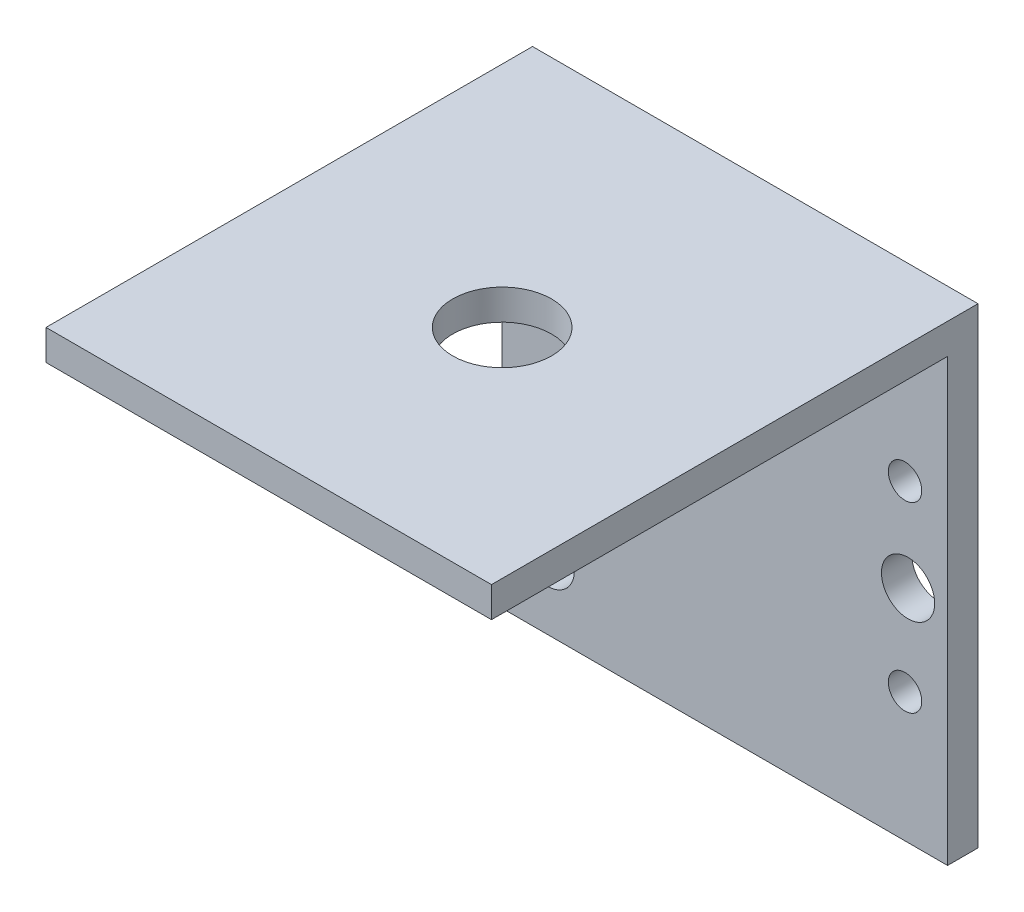
ISO-10303-21;
HEADER;
FILE_DESCRIPTION(('STEP AP214'),'2;1');
FILE_NAME('part.step','',(''),(''),'','','');
FILE_SCHEMA(('AUTOMOTIVE_DESIGN { 1 0 10303 214 1 1 1 1 }'));
ENDSEC;
DATA;
#1=APPLICATION_CONTEXT('core data for automotive mechanical design processes');
#2=APPLICATION_PROTOCOL_DEFINITION('international standard','automotive_design',2000,#1);
#3=PRODUCT_CONTEXT('',#1,'mechanical');
#4=PRODUCT('Part','Part','',(#3));
#5=PRODUCT_RELATED_PRODUCT_CATEGORY('part','',(#4));
#6=PRODUCT_DEFINITION_FORMATION('','',#4);
#7=PRODUCT_DEFINITION_CONTEXT('part definition',#1,'design');
#8=PRODUCT_DEFINITION('design','',#6,#7);
#9=PRODUCT_DEFINITION_SHAPE('','',#8);
#10=(LENGTH_UNIT() NAMED_UNIT(*) SI_UNIT(.MILLI.,.METRE.));
#11=(NAMED_UNIT(*) PLANE_ANGLE_UNIT() SI_UNIT($,.RADIAN.));
#12=(NAMED_UNIT(*) SI_UNIT($,.STERADIAN.) SOLID_ANGLE_UNIT());
#13=UNCERTAINTY_MEASURE_WITH_UNIT(LENGTH_MEASURE(1.E-05),#10,'distance_accuracy_value','');
#14=(GEOMETRIC_REPRESENTATION_CONTEXT(3) GLOBAL_UNCERTAINTY_ASSIGNED_CONTEXT((#13)) GLOBAL_UNIT_ASSIGNED_CONTEXT((#10,
#11,#12)) REPRESENTATION_CONTEXT('',''));
#15=CARTESIAN_POINT('',(0.,0.,0.));
#16=DIRECTION('',(0.,0.,1.));
#17=DIRECTION('',(1.,0.,0.));
#18=AXIS2_PLACEMENT_3D('',#15,#16,#17);
#19=CARTESIAN_POINT('',(14.65,14.5,2.));
#20=DIRECTION('',(-1.,0.,0.));
#21=DIRECTION('',(0.,-1.,0.));
#22=AXIS2_PLACEMENT_3D('',#19,#20,#21);
#23=PLANE('',#22);
#24=DIRECTION('',(0.,1.,0.));
#25=VECTOR('',#24,1.);
#26=CARTESIAN_POINT('',(14.65,14.5,0.));
#27=LINE('',#26,#25);
#28=CARTESIAN_POINT('',(14.65,-14.5,0.));
#29=VERTEX_POINT('',#28);
#30=CARTESIAN_POINT('',(14.65,16.5,0.));
#31=VERTEX_POINT('',#30);
#32=EDGE_CURVE('E101',#29,#31,#27,.T.);
#33=ORIENTED_EDGE('',*,*,#32,.T.);
#34=DIRECTION('',(0.,0.,1.));
#35=VECTOR('',#34,1.);
#36=CARTESIAN_POINT('',(14.65,16.5,0.));
#37=LINE('',#36,#35);
#38=CARTESIAN_POINT('',(14.65,16.5,32.));
#39=VERTEX_POINT('',#38);
#40=EDGE_CURVE('E132',#31,#39,#37,.T.);
#41=ORIENTED_EDGE('',*,*,#40,.T.);
#42=DIRECTION('',(0.,1.,0.));
#43=VECTOR('',#42,1.);
#44=CARTESIAN_POINT('',(14.65,14.5,32.));
#45=LINE('',#44,#43);
#46=CARTESIAN_POINT('',(14.65,14.5,32.));
#47=VERTEX_POINT('',#46);
#48=EDGE_CURVE('E125',#47,#39,#45,.T.);
#49=ORIENTED_EDGE('',*,*,#48,.F.);
#50=DIRECTION('',(0.,0.,1.));
#51=VECTOR('',#50,1.);
#52=CARTESIAN_POINT('',(14.65,14.5,0.));
#53=LINE('',#52,#51);
#54=CARTESIAN_POINT('',(14.65,14.5,2.));
#55=VERTEX_POINT('',#54);
#56=EDGE_CURVE('E88',#55,#47,#53,.T.);
#57=ORIENTED_EDGE('',*,*,#56,.F.);
#58=DIRECTION('',(0.,1.,0.));
#59=VECTOR('',#58,1.);
#60=CARTESIAN_POINT('',(14.65,14.5,2.));
#61=LINE('',#60,#59);
#62=CARTESIAN_POINT('',(14.65,-14.5,2.));
#63=VERTEX_POINT('',#62);
#64=EDGE_CURVE('E94',#63,#55,#61,.T.);
#65=ORIENTED_EDGE('',*,*,#64,.F.);
#66=DIRECTION('',(0.,0.,-1.));
#67=VECTOR('',#66,1.);
#68=CARTESIAN_POINT('',(14.65,-14.5,2.));
#69=LINE('',#68,#67);
#70=EDGE_CURVE('E44',#63,#29,#69,.T.);
#71=ORIENTED_EDGE('',*,*,#70,.T.);
#72=EDGE_LOOP('',(#33,#41,#49,#57,#65,#71));
#73=FACE_BOUND('',#72,.T.);
#74=ADVANCED_FACE('F35',(#73),#23,.F.);
#75=CARTESIAN_POINT('',(-14.65,14.5,2.));
#76=DIRECTION('',(1.,0.,0.));
#77=DIRECTION('',(0.,1.,0.));
#78=AXIS2_PLACEMENT_3D('',#75,#76,#77);
#79=PLANE('',#78);
#80=DIRECTION('',(0.,-1.,0.));
#81=VECTOR('',#80,1.);
#82=CARTESIAN_POINT('',(-14.65,14.5,0.));
#83=LINE('',#82,#81);
#84=CARTESIAN_POINT('',(-14.65,16.5,0.));
#85=VERTEX_POINT('',#84);
#86=CARTESIAN_POINT('',(-14.65,-14.5,0.));
#87=VERTEX_POINT('',#86);
#88=EDGE_CURVE('E64',#85,#87,#83,.T.);
#89=ORIENTED_EDGE('',*,*,#88,.T.);
#90=DIRECTION('',(0.,0.,-1.));
#91=VECTOR('',#90,1.);
#92=CARTESIAN_POINT('',(-14.65,-14.5,2.));
#93=LINE('',#92,#91);
#94=CARTESIAN_POINT('',(-14.65,-14.5,2.));
#95=VERTEX_POINT('',#94);
#96=EDGE_CURVE('E11',#95,#87,#93,.T.);
#97=ORIENTED_EDGE('',*,*,#96,.F.);
#98=DIRECTION('',(0.,-1.,0.));
#99=VECTOR('',#98,1.);
#100=CARTESIAN_POINT('',(-14.65,14.5,2.));
#101=LINE('',#100,#99);
#102=CARTESIAN_POINT('',(-14.65,14.5,2.));
#103=VERTEX_POINT('',#102);
#104=EDGE_CURVE('E92',#103,#95,#101,.T.);
#105=ORIENTED_EDGE('',*,*,#104,.F.);
#106=DIRECTION('',(0.,0.,1.));
#107=VECTOR('',#106,1.);
#108=CARTESIAN_POINT('',(-14.65,14.5,0.));
#109=LINE('',#108,#107);
#110=CARTESIAN_POINT('',(-14.65,14.5,32.));
#111=VERTEX_POINT('',#110);
#112=EDGE_CURVE('E80',#103,#111,#109,.T.);
#113=ORIENTED_EDGE('',*,*,#112,.T.);
#114=DIRECTION('',(0.,-1.,0.));
#115=VECTOR('',#114,1.);
#116=CARTESIAN_POINT('',(-14.65,14.5,32.));
#117=LINE('',#116,#115);
#118=CARTESIAN_POINT('',(-14.65,16.5,32.));
#119=VERTEX_POINT('',#118);
#120=EDGE_CURVE('E345',#119,#111,#117,.T.);
#121=ORIENTED_EDGE('',*,*,#120,.F.);
#122=DIRECTION('',(0.,0.,1.));
#123=VECTOR('',#122,1.);
#124=CARTESIAN_POINT('',(-14.65,16.5,0.));
#125=LINE('',#124,#123);
#126=EDGE_CURVE('E129',#85,#119,#125,.T.);
#127=ORIENTED_EDGE('',*,*,#126,.F.);
#128=EDGE_LOOP('',(#89,#97,#105,#113,#121,#127));
#129=FACE_BOUND('',#128,.T.);
#130=ADVANCED_FACE('F96',(#129),#79,.F.);
#131=CARTESIAN_POINT('',(-14.65,-14.5,2.));
#132=DIRECTION('',(0.,1.,0.));
#133=DIRECTION('',(0.,0.,1.));
#134=AXIS2_PLACEMENT_3D('',#131,#132,#133);
#135=PLANE('',#134);
#136=DIRECTION('',(1.,0.,0.));
#137=VECTOR('',#136,1.);
#138=CARTESIAN_POINT('',(-14.65,-14.5,0.));
#139=LINE('',#138,#137);
#140=EDGE_CURVE('E106',#87,#29,#139,.T.);
#141=ORIENTED_EDGE('',*,*,#140,.T.);
#142=ORIENTED_EDGE('',*,*,#70,.F.);
#143=DIRECTION('',(1.,0.,0.));
#144=VECTOR('',#143,1.);
#145=CARTESIAN_POINT('',(-14.65,-14.5,2.));
#146=LINE('',#145,#144);
#147=EDGE_CURVE('E52',#95,#63,#146,.T.);
#148=ORIENTED_EDGE('',*,*,#147,.F.);
#149=ORIENTED_EDGE('',*,*,#96,.T.);
#150=EDGE_LOOP('',(#141,#142,#148,#149));
#151=FACE_BOUND('',#150,.T.);
#152=ADVANCED_FACE('F179',(#151),#135,.F.);
#153=CARTESIAN_POINT('',(0.,0.,2.));
#154=DIRECTION('',(0.,0.,1.));
#155=DIRECTION('',(1.,0.,0.));
#156=AXIS2_PLACEMENT_3D('',#153,#154,#155);
#157=PLANE('',#156);
#158=CARTESIAN_POINT('',(-10.15,-6.0048125160935,2.));
#159=DIRECTION('',(0.,0.,1.));
#160=DIRECTION('',(1.,0.,0.));
#161=AXIS2_PLACEMENT_3D('',#158,#159,#160);
#162=CIRCLE('',#161,1.1);
#163=CARTESIAN_POINT('',(-9.05000000000001,-6.0048125160935,2.));
#164=VERTEX_POINT('',#163);
#165=EDGE_CURVE('E139',#164,#164,#162,.T.);
#166=ORIENTED_EDGE('',*,*,#165,.F.);
#167=EDGE_LOOP('',(#166));
#168=FACE_BOUND('',#167,.T.);
#169=CARTESIAN_POINT('',(11.85,5.9951874839065,2.));
#170=DIRECTION('',(0.,0.,1.));
#171=DIRECTION('',(1.,0.,0.));
#172=AXIS2_PLACEMENT_3D('',#169,#170,#171);
#173=CIRCLE('',#172,1.1);
#174=CARTESIAN_POINT('',(12.95,5.9951874839065,2.));
#175=VERTEX_POINT('',#174);
#176=EDGE_CURVE('E145',#175,#175,#173,.T.);
#177=ORIENTED_EDGE('',*,*,#176,.F.);
#178=EDGE_LOOP('',(#177));
#179=FACE_BOUND('',#178,.T.);
#180=CARTESIAN_POINT('',(11.85,-6.0048125160935,2.));
#181=DIRECTION('',(0.,0.,1.));
#182=DIRECTION('',(1.,0.,0.));
#183=AXIS2_PLACEMENT_3D('',#180,#181,#182);
#184=CIRCLE('',#183,1.1);
#185=CARTESIAN_POINT('',(12.95,-6.0048125160935,2.));
#186=VERTEX_POINT('',#185);
#187=EDGE_CURVE('E131',#186,#186,#184,.T.);
#188=ORIENTED_EDGE('',*,*,#187,.F.);
#189=EDGE_LOOP('',(#188));
#190=FACE_BOUND('',#189,.T.);
#191=CARTESIAN_POINT('',(-10.15,5.9951874839065,2.));
#192=DIRECTION('',(0.,0.,1.));
#193=DIRECTION('',(1.,0.,0.));
#194=AXIS2_PLACEMENT_3D('',#191,#192,#193);
#195=CIRCLE('',#194,1.1);
#196=CARTESIAN_POINT('',(-9.05000000000001,5.9951874839065,2.));
#197=VERTEX_POINT('',#196);
#198=EDGE_CURVE('E138',#197,#197,#195,.T.);
#199=ORIENTED_EDGE('',*,*,#198,.F.);
#200=EDGE_LOOP('',(#199));
#201=FACE_BOUND('',#200,.T.);
#202=CARTESIAN_POINT('',(-11.65,-10.,2.));
#203=DIRECTION('',(0.,0.,1.));
#204=DIRECTION('',(1.,0.,0.));
#205=AXIS2_PLACEMENT_3D('',#202,#203,#204);
#206=CIRCLE('',#205,1.75);
#207=CARTESIAN_POINT('',(-9.90000000000001,-10.,2.));
#208=VERTEX_POINT('',#207);
#209=EDGE_CURVE('E163',#208,#208,#206,.T.);
#210=ORIENTED_EDGE('',*,*,#209,.F.);
#211=EDGE_LOOP('',(#210));
#212=FACE_BOUND('',#211,.T.);
#213=CARTESIAN_POINT('',(12.05,0.,2.));
#214=DIRECTION('',(0.,0.,1.));
#215=DIRECTION('',(1.,0.,0.));
#216=AXIS2_PLACEMENT_3D('',#213,#214,#215);
#217=CIRCLE('',#216,1.75);
#218=CARTESIAN_POINT('',(13.8,0.,2.));
#219=VERTEX_POINT('',#218);
#220=EDGE_CURVE('E156',#219,#219,#217,.T.);
#221=ORIENTED_EDGE('',*,*,#220,.F.);
#222=EDGE_LOOP('',(#221));
#223=FACE_BOUND('',#222,.T.);
#224=CARTESIAN_POINT('',(-11.65,10.,2.));
#225=DIRECTION('',(0.,0.,1.));
#226=DIRECTION('',(1.,0.,0.));
#227=AXIS2_PLACEMENT_3D('',#224,#225,#226);
#228=CIRCLE('',#227,1.75);
#229=CARTESIAN_POINT('',(-9.90000000000001,10.,2.));
#230=VERTEX_POINT('',#229);
#231=EDGE_CURVE('E162',#230,#230,#228,.T.);
#232=ORIENTED_EDGE('',*,*,#231,.F.);
#233=EDGE_LOOP('',(#232));
#234=FACE_BOUND('',#233,.T.);
#235=ORIENTED_EDGE('',*,*,#64,.T.);
#236=DIRECTION('',(-1.,0.,0.));
#237=VECTOR('',#236,1.);
#238=CARTESIAN_POINT('',(-14.65,14.5,2.));
#239=LINE('',#238,#237);
#240=EDGE_CURVE('E73',#55,#103,#239,.T.);
#241=ORIENTED_EDGE('',*,*,#240,.T.);
#242=ORIENTED_EDGE('',*,*,#104,.T.);
#243=ORIENTED_EDGE('',*,*,#147,.T.);
#244=EDGE_LOOP('',(#235,#241,#242,#243));
#245=FACE_BOUND('',#244,.T.);
#246=ADVANCED_FACE('F91',(#168,#179,#190,#201,#212,#223,#234,#245),#157,.T.);
#247=CARTESIAN_POINT('',(0.,0.,0.));
#248=DIRECTION('',(0.,0.,1.));
#249=DIRECTION('',(1.,0.,0.));
#250=AXIS2_PLACEMENT_3D('',#247,#248,#249);
#251=PLANE('',#250);
#252=CARTESIAN_POINT('',(-10.15,-6.0048125160935,0.));
#253=DIRECTION('',(0.,0.,1.));
#254=DIRECTION('',(1.,0.,0.));
#255=AXIS2_PLACEMENT_3D('',#252,#253,#254);
#256=CIRCLE('',#255,1.1);
#257=CARTESIAN_POINT('',(-9.05000000000001,-6.0048125160935,0.));
#258=VERTEX_POINT('',#257);
#259=EDGE_CURVE('E135',#258,#258,#256,.T.);
#260=ORIENTED_EDGE('',*,*,#259,.T.);
#261=EDGE_LOOP('',(#260));
#262=FACE_BOUND('',#261,.T.);
#263=CARTESIAN_POINT('',(11.85,5.9951874839065,0.));
#264=DIRECTION('',(0.,0.,1.));
#265=DIRECTION('',(1.,0.,0.));
#266=AXIS2_PLACEMENT_3D('',#263,#264,#265);
#267=CIRCLE('',#266,1.1);
#268=CARTESIAN_POINT('',(12.95,5.9951874839065,0.));
#269=VERTEX_POINT('',#268);
#270=EDGE_CURVE('E142',#269,#269,#267,.T.);
#271=ORIENTED_EDGE('',*,*,#270,.T.);
#272=EDGE_LOOP('',(#271));
#273=FACE_BOUND('',#272,.T.);
#274=CARTESIAN_POINT('',(11.85,-6.0048125160935,0.));
#275=DIRECTION('',(0.,0.,1.));
#276=DIRECTION('',(1.,0.,0.));
#277=AXIS2_PLACEMENT_3D('',#274,#275,#276);
#278=CIRCLE('',#277,1.1);
#279=CARTESIAN_POINT('',(12.95,-6.0048125160935,0.));
#280=VERTEX_POINT('',#279);
#281=EDGE_CURVE('E148',#280,#280,#278,.T.);
#282=ORIENTED_EDGE('',*,*,#281,.T.);
#283=EDGE_LOOP('',(#282));
#284=FACE_BOUND('',#283,.T.);
#285=CARTESIAN_POINT('',(-10.15,5.9951874839065,0.));
#286=DIRECTION('',(0.,0.,1.));
#287=DIRECTION('',(1.,0.,0.));
#288=AXIS2_PLACEMENT_3D('',#285,#286,#287);
#289=CIRCLE('',#288,1.1);
#290=CARTESIAN_POINT('',(-9.05000000000001,5.9951874839065,0.));
#291=VERTEX_POINT('',#290);
#292=EDGE_CURVE('E153',#291,#291,#289,.T.);
#293=ORIENTED_EDGE('',*,*,#292,.T.);
#294=EDGE_LOOP('',(#293));
#295=FACE_BOUND('',#294,.T.);
#296=CARTESIAN_POINT('',(-11.65,-10.,0.));
#297=DIRECTION('',(0.,0.,1.));
#298=DIRECTION('',(1.,0.,0.));
#299=AXIS2_PLACEMENT_3D('',#296,#297,#298);
#300=CIRCLE('',#299,1.75);
#301=CARTESIAN_POINT('',(-9.90000000000001,-10.,0.));
#302=VERTEX_POINT('',#301);
#303=EDGE_CURVE('E159',#302,#302,#300,.T.);
#304=ORIENTED_EDGE('',*,*,#303,.T.);
#305=EDGE_LOOP('',(#304));
#306=FACE_BOUND('',#305,.T.);
#307=CARTESIAN_POINT('',(12.05,0.,0.));
#308=DIRECTION('',(0.,0.,1.));
#309=DIRECTION('',(1.,0.,0.));
#310=AXIS2_PLACEMENT_3D('',#307,#308,#309);
#311=CIRCLE('',#310,1.75);
#312=CARTESIAN_POINT('',(13.8,0.,0.));
#313=VERTEX_POINT('',#312);
#314=EDGE_CURVE('E166',#313,#313,#311,.T.);
#315=ORIENTED_EDGE('',*,*,#314,.T.);
#316=EDGE_LOOP('',(#315));
#317=FACE_BOUND('',#316,.T.);
#318=CARTESIAN_POINT('',(-11.65,10.,0.));
#319=DIRECTION('',(0.,0.,1.));
#320=DIRECTION('',(1.,0.,0.));
#321=AXIS2_PLACEMENT_3D('',#318,#319,#320);
#322=CIRCLE('',#321,1.75);
#323=CARTESIAN_POINT('',(-9.90000000000001,10.,0.));
#324=VERTEX_POINT('',#323);
#325=EDGE_CURVE('E104',#324,#324,#322,.T.);
#326=ORIENTED_EDGE('',*,*,#325,.T.);
#327=EDGE_LOOP('',(#326));
#328=FACE_BOUND('',#327,.T.);
#329=ORIENTED_EDGE('',*,*,#32,.F.);
#330=ORIENTED_EDGE('',*,*,#140,.F.);
#331=ORIENTED_EDGE('',*,*,#88,.F.);
#332=DIRECTION('',(-1.,0.,0.));
#333=VECTOR('',#332,1.);
#334=CARTESIAN_POINT('',(-14.65,16.5,0.));
#335=LINE('',#334,#333);
#336=EDGE_CURVE('E89',#31,#85,#335,.T.);
#337=ORIENTED_EDGE('',*,*,#336,.F.);
#338=EDGE_LOOP('',(#329,#330,#331,#337));
#339=FACE_BOUND('',#338,.T.);
#340=ADVANCED_FACE('F117',(#262,#273,#284,#295,#306,#317,#328,#339),#251,.F.);
#341=CARTESIAN_POINT('',(-11.65,10.,0.));
#342=DIRECTION('',(0.,0.,1.));
#343=DIRECTION('',(1.,0.,0.));
#344=AXIS2_PLACEMENT_3D('',#341,#342,#343);
#345=CYLINDRICAL_SURFACE('',#344,1.75);
#346=ORIENTED_EDGE('',*,*,#325,.F.);
#347=EDGE_LOOP('',(#346));
#348=FACE_BOUND('',#347,.T.);
#349=ORIENTED_EDGE('',*,*,#231,.T.);
#350=EDGE_LOOP('',(#349));
#351=FACE_BOUND('',#350,.T.);
#352=ADVANCED_FACE('F176',(#348,#351),#345,.F.);
#353=CARTESIAN_POINT('',(12.05,0.,0.));
#354=DIRECTION('',(0.,0.,1.));
#355=DIRECTION('',(1.,0.,0.));
#356=AXIS2_PLACEMENT_3D('',#353,#354,#355);
#357=CYLINDRICAL_SURFACE('',#356,1.75);
#358=ORIENTED_EDGE('',*,*,#314,.F.);
#359=EDGE_LOOP('',(#358));
#360=FACE_BOUND('',#359,.T.);
#361=ORIENTED_EDGE('',*,*,#220,.T.);
#362=EDGE_LOOP('',(#361));
#363=FACE_BOUND('',#362,.T.);
#364=ADVANCED_FACE('F209',(#360,#363),#357,.F.);
#365=CARTESIAN_POINT('',(-11.65,-10.,0.));
#366=DIRECTION('',(0.,0.,1.));
#367=DIRECTION('',(1.,0.,0.));
#368=AXIS2_PLACEMENT_3D('',#365,#366,#367);
#369=CYLINDRICAL_SURFACE('',#368,1.75);
#370=ORIENTED_EDGE('',*,*,#303,.F.);
#371=EDGE_LOOP('',(#370));
#372=FACE_BOUND('',#371,.T.);
#373=ORIENTED_EDGE('',*,*,#209,.T.);
#374=EDGE_LOOP('',(#373));
#375=FACE_BOUND('',#374,.T.);
#376=ADVANCED_FACE('F217',(#372,#375),#369,.F.);
#377=CARTESIAN_POINT('',(-10.15,5.9951874839065,0.));
#378=DIRECTION('',(0.,0.,1.));
#379=DIRECTION('',(1.,0.,0.));
#380=AXIS2_PLACEMENT_3D('',#377,#378,#379);
#381=CYLINDRICAL_SURFACE('',#380,1.1);
#382=ORIENTED_EDGE('',*,*,#292,.F.);
#383=EDGE_LOOP('',(#382));
#384=FACE_BOUND('',#383,.T.);
#385=ORIENTED_EDGE('',*,*,#198,.T.);
#386=EDGE_LOOP('',(#385));
#387=FACE_BOUND('',#386,.T.);
#388=ADVANCED_FACE('F225',(#384,#387),#381,.F.);
#389=CARTESIAN_POINT('',(11.85,-6.0048125160935,0.));
#390=DIRECTION('',(0.,0.,1.));
#391=DIRECTION('',(1.,0.,0.));
#392=AXIS2_PLACEMENT_3D('',#389,#390,#391);
#393=CYLINDRICAL_SURFACE('',#392,1.1);
#394=ORIENTED_EDGE('',*,*,#281,.F.);
#395=EDGE_LOOP('',(#394));
#396=FACE_BOUND('',#395,.T.);
#397=ORIENTED_EDGE('',*,*,#187,.T.);
#398=EDGE_LOOP('',(#397));
#399=FACE_BOUND('',#398,.T.);
#400=ADVANCED_FACE('F233',(#396,#399),#393,.F.);
#401=CARTESIAN_POINT('',(11.85,5.9951874839065,0.));
#402=DIRECTION('',(0.,0.,1.));
#403=DIRECTION('',(1.,0.,0.));
#404=AXIS2_PLACEMENT_3D('',#401,#402,#403);
#405=CYLINDRICAL_SURFACE('',#404,1.1);
#406=ORIENTED_EDGE('',*,*,#270,.F.);
#407=EDGE_LOOP('',(#406));
#408=FACE_BOUND('',#407,.T.);
#409=ORIENTED_EDGE('',*,*,#176,.T.);
#410=EDGE_LOOP('',(#409));
#411=FACE_BOUND('',#410,.T.);
#412=ADVANCED_FACE('F241',(#408,#411),#405,.F.);
#413=CARTESIAN_POINT('',(-10.15,-6.0048125160935,0.));
#414=DIRECTION('',(0.,0.,1.));
#415=DIRECTION('',(1.,0.,0.));
#416=AXIS2_PLACEMENT_3D('',#413,#414,#415);
#417=CYLINDRICAL_SURFACE('',#416,1.1);
#418=ORIENTED_EDGE('',*,*,#259,.F.);
#419=EDGE_LOOP('',(#418));
#420=FACE_BOUND('',#419,.T.);
#421=ORIENTED_EDGE('',*,*,#165,.T.);
#422=EDGE_LOOP('',(#421));
#423=FACE_BOUND('',#422,.T.);
#424=ADVANCED_FACE('F249',(#420,#423),#417,.F.);
#425=CARTESIAN_POINT('',(-14.65,14.5,0.));
#426=DIRECTION('',(0.,-1.,0.));
#427=DIRECTION('',(0.,0.,-1.));
#428=AXIS2_PLACEMENT_3D('',#425,#426,#427);
#429=PLANE('',#428);
#430=CARTESIAN_POINT('',(0.349999999999993,14.5,17.));
#431=DIRECTION('',(0.,-1.,0.));
#432=DIRECTION('',(0.,0.,-1.));
#433=AXIS2_PLACEMENT_3D('',#430,#431,#432);
#434=CIRCLE('',#433,3.25);
#435=CARTESIAN_POINT('',(0.349999999999993,14.5,13.75));
#436=VERTEX_POINT('',#435);
#437=EDGE_CURVE('E343',#436,#436,#434,.T.);
#438=ORIENTED_EDGE('',*,*,#437,.F.);
#439=EDGE_LOOP('',(#438));
#440=FACE_BOUND('',#439,.T.);
#441=ORIENTED_EDGE('',*,*,#240,.F.);
#442=ORIENTED_EDGE('',*,*,#56,.T.);
#443=DIRECTION('',(1.,0.,0.));
#444=VECTOR('',#443,1.);
#445=CARTESIAN_POINT('',(-14.65,14.5,32.));
#446=LINE('',#445,#444);
#447=EDGE_CURVE('E84',#111,#47,#446,.T.);
#448=ORIENTED_EDGE('',*,*,#447,.F.);
#449=ORIENTED_EDGE('',*,*,#112,.F.);
#450=EDGE_LOOP('',(#441,#442,#448,#449));
#451=FACE_BOUND('',#450,.T.);
#452=ADVANCED_FACE('F81',(#440,#451),#429,.T.);
#453=CARTESIAN_POINT('',(-14.65,16.5,0.));
#454=DIRECTION('',(0.,1.,0.));
#455=DIRECTION('',(0.,0.,1.));
#456=AXIS2_PLACEMENT_3D('',#453,#454,#455);
#457=PLANE('',#456);
#458=CARTESIAN_POINT('',(0.349999999999993,16.5,17.));
#459=DIRECTION('',(0.,1.,0.));
#460=DIRECTION('',(0.,0.,1.));
#461=AXIS2_PLACEMENT_3D('',#458,#459,#460);
#462=CIRCLE('',#461,3.25);
#463=CARTESIAN_POINT('',(0.349999999999993,16.5,20.25));
#464=VERTEX_POINT('',#463);
#465=EDGE_CURVE('E38',#464,#464,#462,.T.);
#466=ORIENTED_EDGE('',*,*,#465,.F.);
#467=EDGE_LOOP('',(#466));
#468=FACE_BOUND('',#467,.T.);
#469=ORIENTED_EDGE('',*,*,#126,.T.);
#470=DIRECTION('',(-1.,0.,0.));
#471=VECTOR('',#470,1.);
#472=CARTESIAN_POINT('',(-14.65,16.5,32.));
#473=LINE('',#472,#471);
#474=EDGE_CURVE('E122',#39,#119,#473,.T.);
#475=ORIENTED_EDGE('',*,*,#474,.F.);
#476=ORIENTED_EDGE('',*,*,#40,.F.);
#477=ORIENTED_EDGE('',*,*,#336,.T.);
#478=EDGE_LOOP('',(#469,#475,#476,#477));
#479=FACE_BOUND('',#478,.T.);
#480=ADVANCED_FACE('F264',(#468,#479),#457,.T.);
#481=CARTESIAN_POINT('',(0.,0.,32.));
#482=DIRECTION('',(0.,0.,-1.));
#483=DIRECTION('',(-1.,0.,0.));
#484=AXIS2_PLACEMENT_3D('',#481,#482,#483);
#485=PLANE('',#484);
#486=ORIENTED_EDGE('',*,*,#120,.T.);
#487=ORIENTED_EDGE('',*,*,#447,.T.);
#488=ORIENTED_EDGE('',*,*,#48,.T.);
#489=ORIENTED_EDGE('',*,*,#474,.T.);
#490=EDGE_LOOP('',(#486,#487,#488,#489));
#491=FACE_BOUND('',#490,.T.);
#492=ADVANCED_FACE('F272',(#491),#485,.F.);
#493=CARTESIAN_POINT('',(0.349999999999993,44.5,17.));
#494=DIRECTION('',(0.,-1.,0.));
#495=DIRECTION('',(0.,0.,-1.));
#496=AXIS2_PLACEMENT_3D('',#493,#494,#495);
#497=CYLINDRICAL_SURFACE('',#496,3.25);
#498=ORIENTED_EDGE('',*,*,#465,.T.);
#499=EDGE_LOOP('',(#498));
#500=FACE_BOUND('',#499,.T.);
#501=ORIENTED_EDGE('',*,*,#437,.T.);
#502=EDGE_LOOP('',(#501));
#503=FACE_BOUND('',#502,.T.);
#504=ADVANCED_FACE('F280',(#500,#503),#497,.F.);
#505=CLOSED_SHELL('',(#74,#130,#152,#246,#340,#352,#364,#376,#388,#400,#412,#424,#452,#480,#492,#504));
#506=MANIFOLD_SOLID_BREP('B2',#505);
#507=ADVANCED_BREP_SHAPE_REPRESENTATION('',(#18,#506),#14);
#508=SHAPE_DEFINITION_REPRESENTATION(#9,#507);
ENDSEC;
END-ISO-10303-21;
